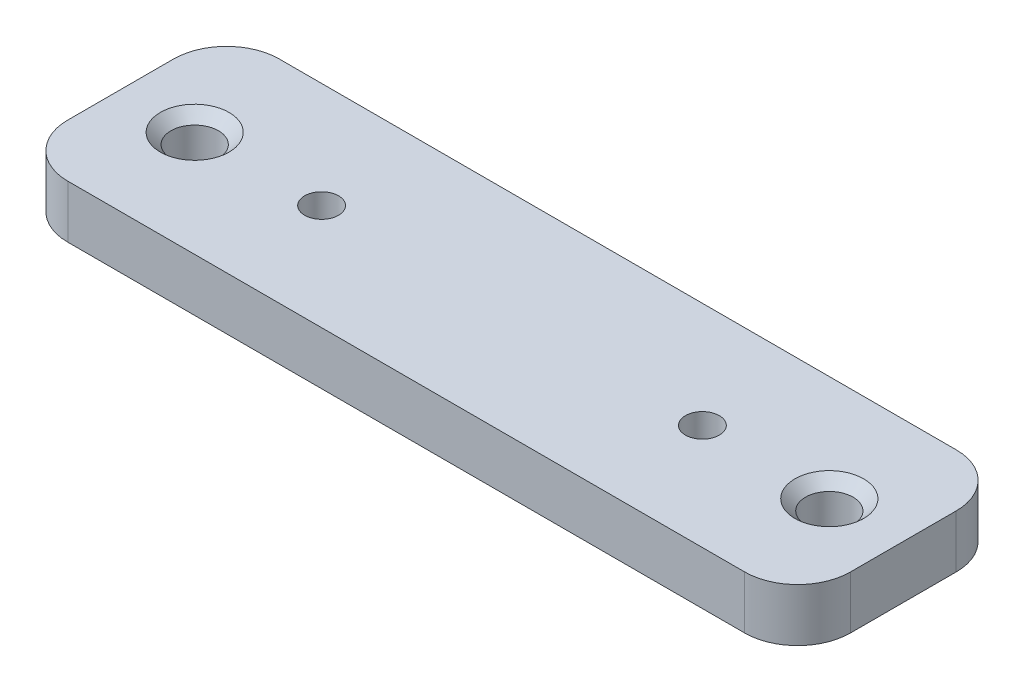
ISO-10303-21;
HEADER;
FILE_DESCRIPTION(('STEP AP214'),'2;1');
FILE_NAME('part.step','',(''),(''),'','','');
FILE_SCHEMA(('AUTOMOTIVE_DESIGN { 1 0 10303 214 1 1 1 1 }'));
ENDSEC;
DATA;
#1=APPLICATION_CONTEXT('core data for automotive mechanical design processes');
#2=APPLICATION_PROTOCOL_DEFINITION('international standard','automotive_design',2000,#1);
#3=PRODUCT_CONTEXT('',#1,'mechanical');
#4=PRODUCT('Part','Part','',(#3));
#5=PRODUCT_RELATED_PRODUCT_CATEGORY('part','',(#4));
#6=PRODUCT_DEFINITION_FORMATION('','',#4);
#7=PRODUCT_DEFINITION_CONTEXT('part definition',#1,'design');
#8=PRODUCT_DEFINITION('design','',#6,#7);
#9=PRODUCT_DEFINITION_SHAPE('','',#8);
#10=(LENGTH_UNIT() NAMED_UNIT(*) SI_UNIT(.MILLI.,.METRE.));
#11=(NAMED_UNIT(*) PLANE_ANGLE_UNIT() SI_UNIT($,.RADIAN.));
#12=(NAMED_UNIT(*) SI_UNIT($,.STERADIAN.) SOLID_ANGLE_UNIT());
#13=UNCERTAINTY_MEASURE_WITH_UNIT(LENGTH_MEASURE(1.E-05),#10,'distance_accuracy_value','');
#14=(GEOMETRIC_REPRESENTATION_CONTEXT(3) GLOBAL_UNCERTAINTY_ASSIGNED_CONTEXT((#13)) GLOBAL_UNIT_ASSIGNED_CONTEXT((#10,
#11,#12)) REPRESENTATION_CONTEXT('',''));
#15=CARTESIAN_POINT('',(0.,0.,0.));
#16=DIRECTION('',(0.,0.,1.));
#17=DIRECTION('',(1.,0.,0.));
#18=AXIS2_PLACEMENT_3D('',#15,#16,#17);
#19=CARTESIAN_POINT('',(0.,5.,0.));
#20=DIRECTION('',(0.,-1.,0.));
#21=DIRECTION('',(0.,0.,-1.));
#22=AXIS2_PLACEMENT_3D('',#19,#20,#21);
#23=PLANE('',#22);
#24=CARTESIAN_POINT('',(67.,5.,-10.));
#25=DIRECTION('',(0.,-1.,0.));
#26=DIRECTION('',(0.,0.,-1.));
#27=AXIS2_PLACEMENT_3D('',#24,#25,#26);
#28=CIRCLE('',#27,3.25000000000001);
#29=CARTESIAN_POINT('',(67.,5.,-13.25));
#30=VERTEX_POINT('',#29);
#31=EDGE_CURVE('E177',#30,#30,#28,.T.);
#32=ORIENTED_EDGE('',*,*,#31,.T.);
#33=EDGE_LOOP('',(#32));
#34=FACE_BOUND('',#33,.T.);
#35=CARTESIAN_POINT('',(7.,5.,-10.));
#36=DIRECTION('',(0.,-1.,0.));
#37=DIRECTION('',(0.,0.,-1.));
#38=AXIS2_PLACEMENT_3D('',#35,#36,#37);
#39=CIRCLE('',#38,3.25000000000001);
#40=CARTESIAN_POINT('',(7.,5.,-13.25));
#41=VERTEX_POINT('',#40);
#42=EDGE_CURVE('E174',#41,#41,#39,.T.);
#43=ORIENTED_EDGE('',*,*,#42,.T.);
#44=EDGE_LOOP('',(#43));
#45=FACE_BOUND('',#44,.T.);
#46=DIRECTION('',(-1.,0.,0.));
#47=VECTOR('',#46,1.);
#48=CARTESIAN_POINT('',(0.,5.,-20.));
#49=LINE('',#48,#47);
#50=CARTESIAN_POINT('',(69.,5.,-20.));
#51=VERTEX_POINT('',#50);
#52=CARTESIAN_POINT('',(5.,5.,-20.));
#53=VERTEX_POINT('',#52);
#54=EDGE_CURVE('E141',#51,#53,#49,.T.);
#55=ORIENTED_EDGE('',*,*,#54,.T.);
#56=CARTESIAN_POINT('',(5.,5.,-15.));
#57=DIRECTION('',(0.,-1.,0.));
#58=DIRECTION('',(0.,0.,-1.));
#59=AXIS2_PLACEMENT_3D('',#56,#57,#58);
#60=CIRCLE('',#59,5.);
#61=CARTESIAN_POINT('',(0.,5.,-15.));
#62=VERTEX_POINT('',#61);
#63=EDGE_CURVE('E160',#53,#62,#60,.F.);
#64=ORIENTED_EDGE('',*,*,#63,.T.);
#65=DIRECTION('',(0.,0.,1.));
#66=VECTOR('',#65,1.);
#67=CARTESIAN_POINT('',(0.,5.,0.));
#68=LINE('',#67,#66);
#69=CARTESIAN_POINT('',(0.,5.,-5.));
#70=VERTEX_POINT('',#69);
#71=EDGE_CURVE('E124',#62,#70,#68,.T.);
#72=ORIENTED_EDGE('',*,*,#71,.T.);
#73=CARTESIAN_POINT('',(5.,5.,-5.));
#74=DIRECTION('',(0.,-1.,0.));
#75=DIRECTION('',(0.,0.,-1.));
#76=AXIS2_PLACEMENT_3D('',#73,#74,#75);
#77=CIRCLE('',#76,5.);
#78=CARTESIAN_POINT('',(5.,5.,0.));
#79=VERTEX_POINT('',#78);
#80=EDGE_CURVE('E158',#70,#79,#77,.F.);
#81=ORIENTED_EDGE('',*,*,#80,.T.);
#82=DIRECTION('',(1.,0.,0.));
#83=VECTOR('',#82,1.);
#84=CARTESIAN_POINT('',(0.,5.,0.));
#85=LINE('',#84,#83);
#86=CARTESIAN_POINT('',(69.,5.,0.));
#87=VERTEX_POINT('',#86);
#88=EDGE_CURVE('E217',#79,#87,#85,.T.);
#89=ORIENTED_EDGE('',*,*,#88,.T.);
#90=CARTESIAN_POINT('',(69.,5.,-5.));
#91=DIRECTION('',(0.,-1.,0.));
#92=DIRECTION('',(0.,0.,-1.));
#93=AXIS2_PLACEMENT_3D('',#90,#91,#92);
#94=CIRCLE('',#93,5.);
#95=CARTESIAN_POINT('',(74.,5.,-5.));
#96=VERTEX_POINT('',#95);
#97=EDGE_CURVE('E59',#87,#96,#94,.F.);
#98=ORIENTED_EDGE('',*,*,#97,.T.);
#99=DIRECTION('',(0.,0.,-1.));
#100=VECTOR('',#99,1.);
#101=CARTESIAN_POINT('',(74.,5.,0.));
#102=LINE('',#101,#100);
#103=CARTESIAN_POINT('',(74.,5.,-15.));
#104=VERTEX_POINT('',#103);
#105=EDGE_CURVE('E218',#96,#104,#102,.T.);
#106=ORIENTED_EDGE('',*,*,#105,.T.);
#107=CARTESIAN_POINT('',(69.,5.,-15.));
#108=DIRECTION('',(0.,-1.,0.));
#109=DIRECTION('',(0.,0.,-1.));
#110=AXIS2_PLACEMENT_3D('',#107,#108,#109);
#111=CIRCLE('',#110,5.);
#112=EDGE_CURVE('E156',#104,#51,#111,.F.);
#113=ORIENTED_EDGE('',*,*,#112,.T.);
#114=EDGE_LOOP('',(#55,#64,#72,#81,#89,#98,#106,#113));
#115=FACE_BOUND('',#114,.T.);
#116=CARTESIAN_POINT('',(19.,5.,-10.));
#117=DIRECTION('',(0.,1.,0.));
#118=DIRECTION('',(0.,0.,1.));
#119=AXIS2_PLACEMENT_3D('',#116,#117,#118);
#120=CIRCLE('',#119,1.6);
#121=CARTESIAN_POINT('',(19.,5.,-8.4));
#122=VERTEX_POINT('',#121);
#123=EDGE_CURVE('E132',#122,#122,#120,.T.);
#124=ORIENTED_EDGE('',*,*,#123,.F.);
#125=EDGE_LOOP('',(#124));
#126=FACE_BOUND('',#125,.T.);
#127=CARTESIAN_POINT('',(55.,5.,-10.));
#128=DIRECTION('',(0.,1.,0.));
#129=DIRECTION('',(0.,0.,1.));
#130=AXIS2_PLACEMENT_3D('',#127,#128,#129);
#131=CIRCLE('',#130,1.6);
#132=CARTESIAN_POINT('',(55.,5.,-8.4));
#133=VERTEX_POINT('',#132);
#134=EDGE_CURVE('E138',#133,#133,#131,.T.);
#135=ORIENTED_EDGE('',*,*,#134,.F.);
#136=EDGE_LOOP('',(#135));
#137=FACE_BOUND('',#136,.T.);
#138=ADVANCED_FACE('F37',(#34,#45,#115,#126,#137),#23,.F.);
#139=CARTESIAN_POINT('',(0.,0.,0.));
#140=DIRECTION('',(0.,-1.,0.));
#141=DIRECTION('',(0.,0.,-1.));
#142=AXIS2_PLACEMENT_3D('',#139,#140,#141);
#143=PLANE('',#142);
#144=CARTESIAN_POINT('',(55.,0.,-10.));
#145=DIRECTION('',(0.,-1.,0.));
#146=DIRECTION('',(0.,0.,-1.));
#147=AXIS2_PLACEMENT_3D('',#144,#145,#146);
#148=CIRCLE('',#147,2.60000000000001);
#149=CARTESIAN_POINT('',(55.,0.,-12.6));
#150=VERTEX_POINT('',#149);
#151=EDGE_CURVE('E186',#150,#150,#148,.F.);
#152=ORIENTED_EDGE('',*,*,#151,.T.);
#153=EDGE_LOOP('',(#152));
#154=FACE_BOUND('',#153,.T.);
#155=CARTESIAN_POINT('',(19.,0.,-10.));
#156=DIRECTION('',(0.,-1.,0.));
#157=DIRECTION('',(0.,0.,-1.));
#158=AXIS2_PLACEMENT_3D('',#155,#156,#157);
#159=CIRCLE('',#158,2.60000000000001);
#160=CARTESIAN_POINT('',(19.,0.,-12.6));
#161=VERTEX_POINT('',#160);
#162=EDGE_CURVE('E183',#161,#161,#159,.F.);
#163=ORIENTED_EDGE('',*,*,#162,.T.);
#164=EDGE_LOOP('',(#163));
#165=FACE_BOUND('',#164,.T.);
#166=CARTESIAN_POINT('',(7.,0.,-10.));
#167=DIRECTION('',(0.,1.,0.));
#168=DIRECTION('',(0.,0.,1.));
#169=AXIS2_PLACEMENT_3D('',#166,#167,#168);
#170=CIRCLE('',#169,2.25);
#171=CARTESIAN_POINT('',(7.,0.,-7.75));
#172=VERTEX_POINT('',#171);
#173=EDGE_CURVE('E207',#172,#172,#170,.T.);
#174=ORIENTED_EDGE('',*,*,#173,.T.);
#175=EDGE_LOOP('',(#174));
#176=FACE_BOUND('',#175,.T.);
#177=DIRECTION('',(0.,0.,1.));
#178=VECTOR('',#177,1.);
#179=CARTESIAN_POINT('',(0.,0.,0.));
#180=LINE('',#179,#178);
#181=CARTESIAN_POINT('',(0.,0.,-15.));
#182=VERTEX_POINT('',#181);
#183=CARTESIAN_POINT('',(0.,0.,-5.));
#184=VERTEX_POINT('',#183);
#185=EDGE_CURVE('E121',#182,#184,#180,.T.);
#186=ORIENTED_EDGE('',*,*,#185,.F.);
#187=CARTESIAN_POINT('',(5.,0.,-15.));
#188=DIRECTION('',(0.,-1.,0.));
#189=DIRECTION('',(0.,0.,-1.));
#190=AXIS2_PLACEMENT_3D('',#187,#188,#189);
#191=CIRCLE('',#190,5.);
#192=CARTESIAN_POINT('',(5.,0.,-20.));
#193=VERTEX_POINT('',#192);
#194=EDGE_CURVE('E104',#182,#193,#191,.T.);
#195=ORIENTED_EDGE('',*,*,#194,.T.);
#196=DIRECTION('',(-1.,0.,0.));
#197=VECTOR('',#196,1.);
#198=CARTESIAN_POINT('',(0.,0.,-20.));
#199=LINE('',#198,#197);
#200=CARTESIAN_POINT('',(69.,0.,-20.));
#201=VERTEX_POINT('',#200);
#202=EDGE_CURVE('E145',#201,#193,#199,.T.);
#203=ORIENTED_EDGE('',*,*,#202,.F.);
#204=CARTESIAN_POINT('',(69.,0.,-15.));
#205=DIRECTION('',(0.,-1.,0.));
#206=DIRECTION('',(0.,0.,-1.));
#207=AXIS2_PLACEMENT_3D('',#204,#205,#206);
#208=CIRCLE('',#207,5.);
#209=CARTESIAN_POINT('',(74.,0.,-15.));
#210=VERTEX_POINT('',#209);
#211=EDGE_CURVE('E149',#201,#210,#208,.T.);
#212=ORIENTED_EDGE('',*,*,#211,.T.);
#213=DIRECTION('',(0.,0.,-1.));
#214=VECTOR('',#213,1.);
#215=CARTESIAN_POINT('',(74.,0.,0.));
#216=LINE('',#215,#214);
#217=CARTESIAN_POINT('',(74.,0.,-5.));
#218=VERTEX_POINT('',#217);
#219=EDGE_CURVE('E135',#218,#210,#216,.T.);
#220=ORIENTED_EDGE('',*,*,#219,.F.);
#221=CARTESIAN_POINT('',(69.,0.,-5.));
#222=DIRECTION('',(0.,-1.,0.));
#223=DIRECTION('',(0.,0.,-1.));
#224=AXIS2_PLACEMENT_3D('',#221,#222,#223);
#225=CIRCLE('',#224,5.);
#226=CARTESIAN_POINT('',(69.,0.,0.));
#227=VERTEX_POINT('',#226);
#228=EDGE_CURVE('E125',#218,#227,#225,.T.);
#229=ORIENTED_EDGE('',*,*,#228,.T.);
#230=DIRECTION('',(1.,0.,0.));
#231=VECTOR('',#230,1.);
#232=CARTESIAN_POINT('',(0.,0.,0.));
#233=LINE('',#232,#231);
#234=CARTESIAN_POINT('',(5.,0.,0.));
#235=VERTEX_POINT('',#234);
#236=EDGE_CURVE('E131',#235,#227,#233,.T.);
#237=ORIENTED_EDGE('',*,*,#236,.F.);
#238=CARTESIAN_POINT('',(5.,0.,-5.));
#239=DIRECTION('',(0.,-1.,0.));
#240=DIRECTION('',(0.,0.,-1.));
#241=AXIS2_PLACEMENT_3D('',#238,#239,#240);
#242=CIRCLE('',#241,5.);
#243=EDGE_CURVE('E115',#235,#184,#242,.T.);
#244=ORIENTED_EDGE('',*,*,#243,.T.);
#245=EDGE_LOOP('',(#186,#195,#203,#212,#220,#229,#237,#244));
#246=FACE_BOUND('',#245,.T.);
#247=CARTESIAN_POINT('',(67.,0.,-10.));
#248=DIRECTION('',(0.,1.,0.));
#249=DIRECTION('',(0.,0.,1.));
#250=AXIS2_PLACEMENT_3D('',#247,#248,#249);
#251=CIRCLE('',#250,2.25);
#252=CARTESIAN_POINT('',(67.,0.,-7.75));
#253=VERTEX_POINT('',#252);
#254=EDGE_CURVE('E209',#253,#253,#251,.T.);
#255=ORIENTED_EDGE('',*,*,#254,.T.);
#256=EDGE_LOOP('',(#255));
#257=FACE_BOUND('',#256,.T.);
#258=ADVANCED_FACE('F128',(#154,#165,#176,#246,#257),#143,.T.);
#259=CARTESIAN_POINT('',(0.,5.,0.));
#260=DIRECTION('',(1.,0.,0.));
#261=DIRECTION('',(0.,0.,-1.));
#262=AXIS2_PLACEMENT_3D('',#259,#260,#261);
#263=PLANE('',#262);
#264=ORIENTED_EDGE('',*,*,#71,.F.);
#265=DIRECTION('',(0.,-1.,0.));
#266=VECTOR('',#265,1.);
#267=CARTESIAN_POINT('',(0.,5.,-15.));
#268=LINE('',#267,#266);
#269=EDGE_CURVE('E108',#62,#182,#268,.T.);
#270=ORIENTED_EDGE('',*,*,#269,.T.);
#271=ORIENTED_EDGE('',*,*,#185,.T.);
#272=DIRECTION('',(0.,-1.,0.));
#273=VECTOR('',#272,1.);
#274=CARTESIAN_POINT('',(0.,5.,-5.));
#275=LINE('',#274,#273);
#276=EDGE_CURVE('E126',#184,#70,#275,.F.);
#277=ORIENTED_EDGE('',*,*,#276,.T.);
#278=EDGE_LOOP('',(#264,#270,#271,#277));
#279=FACE_BOUND('',#278,.T.);
#280=ADVANCED_FACE('F120',(#279),#263,.F.);
#281=CARTESIAN_POINT('',(0.,5.,0.));
#282=DIRECTION('',(0.,0.,-1.));
#283=DIRECTION('',(-1.,0.,0.));
#284=AXIS2_PLACEMENT_3D('',#281,#282,#283);
#285=PLANE('',#284);
#286=ORIENTED_EDGE('',*,*,#88,.F.);
#287=DIRECTION('',(0.,-1.,0.));
#288=VECTOR('',#287,1.);
#289=CARTESIAN_POINT('',(5.,5.,0.));
#290=LINE('',#289,#288);
#291=EDGE_CURVE('E164',#79,#235,#290,.T.);
#292=ORIENTED_EDGE('',*,*,#291,.T.);
#293=ORIENTED_EDGE('',*,*,#236,.T.);
#294=DIRECTION('',(0.,-1.,0.));
#295=VECTOR('',#294,1.);
#296=CARTESIAN_POINT('',(69.,5.,0.));
#297=LINE('',#296,#295);
#298=EDGE_CURVE('E162',#227,#87,#297,.F.);
#299=ORIENTED_EDGE('',*,*,#298,.T.);
#300=EDGE_LOOP('',(#286,#292,#293,#299));
#301=FACE_BOUND('',#300,.T.);
#302=ADVANCED_FACE('F236',(#301),#285,.F.);
#303=CARTESIAN_POINT('',(74.,5.,0.));
#304=DIRECTION('',(-1.,0.,0.));
#305=DIRECTION('',(0.,0.,1.));
#306=AXIS2_PLACEMENT_3D('',#303,#304,#305);
#307=PLANE('',#306);
#308=ORIENTED_EDGE('',*,*,#219,.T.);
#309=DIRECTION('',(0.,-1.,0.));
#310=VECTOR('',#309,1.);
#311=CARTESIAN_POINT('',(74.,5.,-15.));
#312=LINE('',#311,#310);
#313=EDGE_CURVE('E52',#210,#104,#312,.F.);
#314=ORIENTED_EDGE('',*,*,#313,.T.);
#315=ORIENTED_EDGE('',*,*,#105,.F.);
#316=DIRECTION('',(0.,-1.,0.));
#317=VECTOR('',#316,1.);
#318=CARTESIAN_POINT('',(74.,5.,-5.));
#319=LINE('',#318,#317);
#320=EDGE_CURVE('E167',#96,#218,#319,.T.);
#321=ORIENTED_EDGE('',*,*,#320,.T.);
#322=EDGE_LOOP('',(#308,#314,#315,#321));
#323=FACE_BOUND('',#322,.T.);
#324=ADVANCED_FACE('F229',(#323),#307,.F.);
#325=CARTESIAN_POINT('',(0.,5.,-20.));
#326=DIRECTION('',(0.,0.,1.));
#327=DIRECTION('',(1.,0.,0.));
#328=AXIS2_PLACEMENT_3D('',#325,#326,#327);
#329=PLANE('',#328);
#330=ORIENTED_EDGE('',*,*,#202,.T.);
#331=DIRECTION('',(0.,-1.,0.));
#332=VECTOR('',#331,1.);
#333=CARTESIAN_POINT('',(5.,5.,-20.));
#334=LINE('',#333,#332);
#335=EDGE_CURVE('E109',#193,#53,#334,.F.);
#336=ORIENTED_EDGE('',*,*,#335,.T.);
#337=ORIENTED_EDGE('',*,*,#54,.F.);
#338=DIRECTION('',(0.,-1.,0.));
#339=VECTOR('',#338,1.);
#340=CARTESIAN_POINT('',(69.,5.,-20.));
#341=LINE('',#340,#339);
#342=EDGE_CURVE('E114',#51,#201,#341,.T.);
#343=ORIENTED_EDGE('',*,*,#342,.T.);
#344=EDGE_LOOP('',(#330,#336,#337,#343));
#345=FACE_BOUND('',#344,.T.);
#346=ADVANCED_FACE('F225',(#345),#329,.F.);
#347=CARTESIAN_POINT('',(19.,5.,-10.));
#348=DIRECTION('',(0.,-1.,0.));
#349=DIRECTION('',(0.,0.,-1.));
#350=AXIS2_PLACEMENT_3D('',#347,#348,#349);
#351=CYLINDRICAL_SURFACE('',#350,1.6);
#352=CARTESIAN_POINT('',(19.,1.00000000000002,-10.));
#353=DIRECTION('',(0.,-1.,0.));
#354=DIRECTION('',(0.,0.,-1.));
#355=AXIS2_PLACEMENT_3D('',#352,#353,#354);
#356=CIRCLE('',#355,1.6);
#357=CARTESIAN_POINT('',(19.,1.00000000000002,-11.6));
#358=VERTEX_POINT('',#357);
#359=EDGE_CURVE('E11',#358,#358,#356,.T.);
#360=ORIENTED_EDGE('',*,*,#359,.T.);
#361=EDGE_LOOP('',(#360));
#362=FACE_BOUND('',#361,.T.);
#363=ORIENTED_EDGE('',*,*,#123,.T.);
#364=EDGE_LOOP('',(#363));
#365=FACE_BOUND('',#364,.T.);
#366=ADVANCED_FACE('F257',(#362,#365),#351,.F.);
#367=CARTESIAN_POINT('',(55.,5.,-10.));
#368=DIRECTION('',(0.,-1.,0.));
#369=DIRECTION('',(0.,0.,-1.));
#370=AXIS2_PLACEMENT_3D('',#367,#368,#369);
#371=CYLINDRICAL_SURFACE('',#370,1.6);
#372=CARTESIAN_POINT('',(55.,1.00000000000002,-10.));
#373=DIRECTION('',(0.,-1.,0.));
#374=DIRECTION('',(0.,0.,-1.));
#375=AXIS2_PLACEMENT_3D('',#372,#373,#374);
#376=CIRCLE('',#375,1.6);
#377=CARTESIAN_POINT('',(55.,1.00000000000002,-11.6));
#378=VERTEX_POINT('',#377);
#379=EDGE_CURVE('E45',#378,#378,#376,.T.);
#380=ORIENTED_EDGE('',*,*,#379,.T.);
#381=EDGE_LOOP('',(#380));
#382=FACE_BOUND('',#381,.T.);
#383=ORIENTED_EDGE('',*,*,#134,.T.);
#384=EDGE_LOOP('',(#383));
#385=FACE_BOUND('',#384,.T.);
#386=ADVANCED_FACE('F191',(#382,#385),#371,.F.);
#387=CARTESIAN_POINT('',(7.,5.,-10.));
#388=DIRECTION('',(0.,-1.,0.));
#389=DIRECTION('',(0.,0.,-1.));
#390=AXIS2_PLACEMENT_3D('',#387,#388,#389);
#391=CYLINDRICAL_SURFACE('',#390,2.25);
#392=CARTESIAN_POINT('',(7.,4.,-10.));
#393=DIRECTION('',(0.,-1.,0.));
#394=DIRECTION('',(0.,0.,-1.));
#395=AXIS2_PLACEMENT_3D('',#392,#393,#394);
#396=CIRCLE('',#395,2.25);
#397=CARTESIAN_POINT('',(7.,4.,-12.25));
#398=VERTEX_POINT('',#397);
#399=EDGE_CURVE('E180',#398,#398,#396,.F.);
#400=ORIENTED_EDGE('',*,*,#399,.T.);
#401=EDGE_LOOP('',(#400));
#402=FACE_BOUND('',#401,.T.);
#403=ORIENTED_EDGE('',*,*,#173,.F.);
#404=EDGE_LOOP('',(#403));
#405=FACE_BOUND('',#404,.T.);
#406=ADVANCED_FACE('F296',(#402,#405),#391,.F.);
#407=CARTESIAN_POINT('',(67.,5.,-10.));
#408=DIRECTION('',(0.,-1.,0.));
#409=DIRECTION('',(0.,0.,-1.));
#410=AXIS2_PLACEMENT_3D('',#407,#408,#409);
#411=CYLINDRICAL_SURFACE('',#410,2.25);
#412=CARTESIAN_POINT('',(67.,3.99999999999999,-10.));
#413=DIRECTION('',(0.,-1.,0.));
#414=DIRECTION('',(0.,0.,-1.));
#415=AXIS2_PLACEMENT_3D('',#412,#413,#414);
#416=CIRCLE('',#415,2.25);
#417=CARTESIAN_POINT('',(67.,3.99999999999999,-12.25));
#418=VERTEX_POINT('',#417);
#419=EDGE_CURVE('E171',#418,#418,#416,.F.);
#420=ORIENTED_EDGE('',*,*,#419,.T.);
#421=EDGE_LOOP('',(#420));
#422=FACE_BOUND('',#421,.T.);
#423=ORIENTED_EDGE('',*,*,#254,.F.);
#424=EDGE_LOOP('',(#423));
#425=FACE_BOUND('',#424,.T.);
#426=ADVANCED_FACE('F248',(#422,#425),#411,.F.);
#427=CARTESIAN_POINT('',(5.,5.,-15.));
#428=DIRECTION('',(0.,-1.,0.));
#429=DIRECTION('',(0.,0.,-1.));
#430=AXIS2_PLACEMENT_3D('',#427,#428,#429);
#431=CYLINDRICAL_SURFACE('',#430,5.);
#432=ORIENTED_EDGE('',*,*,#63,.F.);
#433=ORIENTED_EDGE('',*,*,#335,.F.);
#434=ORIENTED_EDGE('',*,*,#194,.F.);
#435=ORIENTED_EDGE('',*,*,#269,.F.);
#436=EDGE_LOOP('',(#432,#433,#434,#435));
#437=FACE_BOUND('',#436,.T.);
#438=ADVANCED_FACE('F107',(#437),#431,.T.);
#439=CARTESIAN_POINT('',(5.,5.,-5.));
#440=DIRECTION('',(0.,-1.,0.));
#441=DIRECTION('',(0.,0.,-1.));
#442=AXIS2_PLACEMENT_3D('',#439,#440,#441);
#443=CYLINDRICAL_SURFACE('',#442,5.);
#444=ORIENTED_EDGE('',*,*,#80,.F.);
#445=ORIENTED_EDGE('',*,*,#276,.F.);
#446=ORIENTED_EDGE('',*,*,#243,.F.);
#447=ORIENTED_EDGE('',*,*,#291,.F.);
#448=EDGE_LOOP('',(#444,#445,#446,#447));
#449=FACE_BOUND('',#448,.T.);
#450=ADVANCED_FACE('F240',(#449),#443,.T.);
#451=CARTESIAN_POINT('',(69.,5.,-15.));
#452=DIRECTION('',(0.,-1.,0.));
#453=DIRECTION('',(0.,0.,-1.));
#454=AXIS2_PLACEMENT_3D('',#451,#452,#453);
#455=CYLINDRICAL_SURFACE('',#454,5.);
#456=ORIENTED_EDGE('',*,*,#112,.F.);
#457=ORIENTED_EDGE('',*,*,#313,.F.);
#458=ORIENTED_EDGE('',*,*,#211,.F.);
#459=ORIENTED_EDGE('',*,*,#342,.F.);
#460=EDGE_LOOP('',(#456,#457,#458,#459));
#461=FACE_BOUND('',#460,.T.);
#462=ADVANCED_FACE('F227',(#461),#455,.T.);
#463=CARTESIAN_POINT('',(69.,5.,-5.));
#464=DIRECTION('',(0.,-1.,0.));
#465=DIRECTION('',(0.,0.,-1.));
#466=AXIS2_PLACEMENT_3D('',#463,#464,#465);
#467=CYLINDRICAL_SURFACE('',#466,5.);
#468=ORIENTED_EDGE('',*,*,#97,.F.);
#469=ORIENTED_EDGE('',*,*,#298,.F.);
#470=ORIENTED_EDGE('',*,*,#228,.F.);
#471=ORIENTED_EDGE('',*,*,#320,.F.);
#472=EDGE_LOOP('',(#468,#469,#470,#471));
#473=FACE_BOUND('',#472,.T.);
#474=ADVANCED_FACE('F232',(#473),#467,.T.);
#475=CARTESIAN_POINT('',(67.,3.99999999999999,-10.));
#476=DIRECTION('',(0.,1.,0.));
#477=DIRECTION('',(0.,0.,1.));
#478=AXIS2_PLACEMENT_3D('',#475,#476,#477);
#479=CONICAL_SURFACE('',#478,2.25,0.785398163397452);
#480=ORIENTED_EDGE('',*,*,#31,.F.);
#481=EDGE_LOOP('',(#480));
#482=FACE_BOUND('',#481,.T.);
#483=ORIENTED_EDGE('',*,*,#419,.F.);
#484=EDGE_LOOP('',(#483));
#485=FACE_BOUND('',#484,.T.);
#486=ADVANCED_FACE('F333',(#482,#485),#479,.F.);
#487=CARTESIAN_POINT('',(7.,4.,-10.));
#488=DIRECTION('',(0.,1.,0.));
#489=DIRECTION('',(0.,0.,1.));
#490=AXIS2_PLACEMENT_3D('',#487,#488,#489);
#491=CONICAL_SURFACE('',#490,2.25,0.785398163397451);
#492=ORIENTED_EDGE('',*,*,#42,.F.);
#493=EDGE_LOOP('',(#492));
#494=FACE_BOUND('',#493,.T.);
#495=ORIENTED_EDGE('',*,*,#399,.F.);
#496=EDGE_LOOP('',(#495));
#497=FACE_BOUND('',#496,.T.);
#498=ADVANCED_FACE('F197',(#494,#497),#491,.F.);
#499=CARTESIAN_POINT('',(55.,0.,-10.));
#500=DIRECTION('',(0.,-1.,0.));
#501=DIRECTION('',(0.,0.,-1.));
#502=AXIS2_PLACEMENT_3D('',#499,#500,#501);
#503=CONICAL_SURFACE('',#502,2.60000000000001,0.785398163397445);
#504=ORIENTED_EDGE('',*,*,#379,.F.);
#505=EDGE_LOOP('',(#504));
#506=FACE_BOUND('',#505,.T.);
#507=ORIENTED_EDGE('',*,*,#151,.F.);
#508=EDGE_LOOP('',(#507));
#509=FACE_BOUND('',#508,.T.);
#510=ADVANCED_FACE('F194',(#506,#509),#503,.F.);
#511=CARTESIAN_POINT('',(19.,0.,-10.));
#512=DIRECTION('',(0.,-1.,0.));
#513=DIRECTION('',(0.,0.,-1.));
#514=AXIS2_PLACEMENT_3D('',#511,#512,#513);
#515=CONICAL_SURFACE('',#514,2.60000000000001,0.785398163397445);
#516=ORIENTED_EDGE('',*,*,#359,.F.);
#517=EDGE_LOOP('',(#516));
#518=FACE_BOUND('',#517,.T.);
#519=ORIENTED_EDGE('',*,*,#162,.F.);
#520=EDGE_LOOP('',(#519));
#521=FACE_BOUND('',#520,.T.);
#522=ADVANCED_FACE('F39',(#518,#521),#515,.F.);
#523=CLOSED_SHELL('',(#138,#258,#280,#302,#324,#346,#366,#386,#406,#426,#438,#450,#462,#474,
#486,#498,#510,#522));
#524=MANIFOLD_SOLID_BREP('B2',#523);
#525=ADVANCED_BREP_SHAPE_REPRESENTATION('',(#18,#524),#14);
#526=SHAPE_DEFINITION_REPRESENTATION(#9,#525);
ENDSEC;
END-ISO-10303-21;
